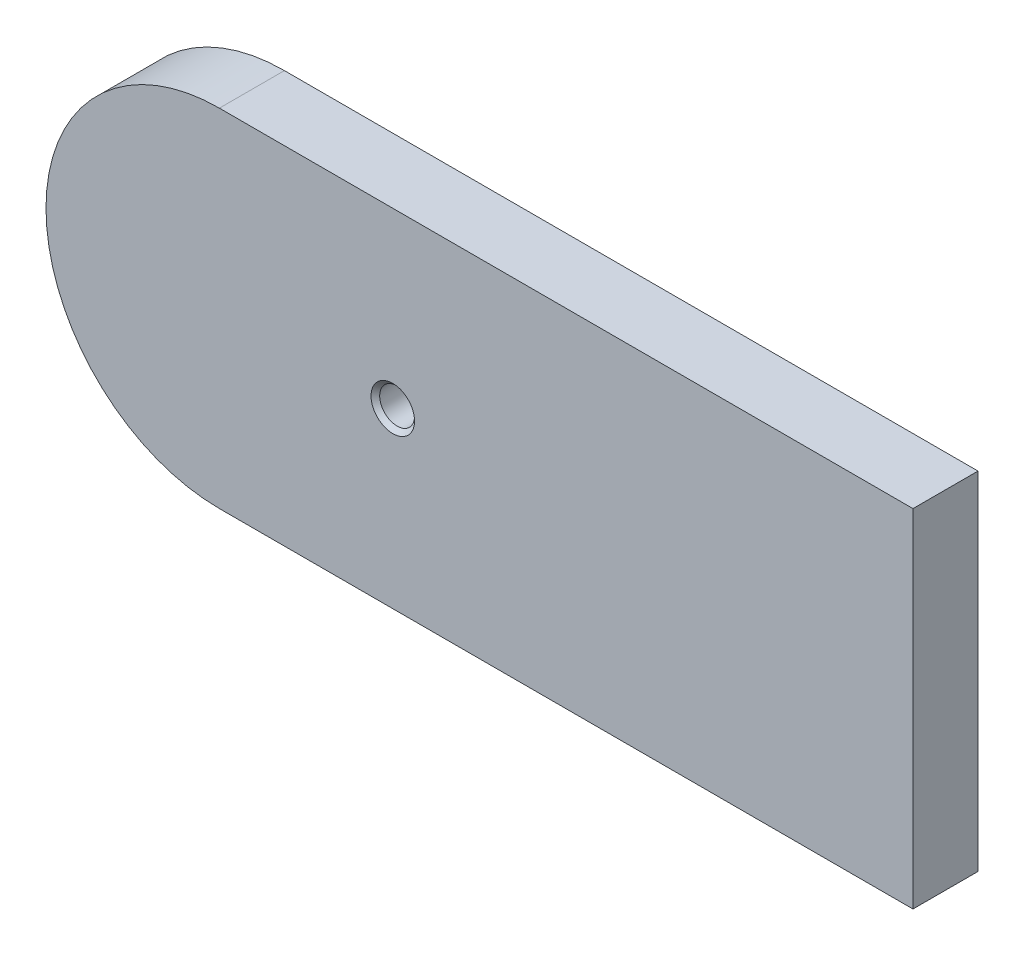
ISO-10303-21;
HEADER;
FILE_DESCRIPTION(('STEP AP214'),'2;1');
FILE_NAME('part.step','',(''),(''),'','','');
FILE_SCHEMA(('AUTOMOTIVE_DESIGN { 1 0 10303 214 1 1 1 1 }'));
ENDSEC;
DATA;
#1=APPLICATION_CONTEXT('core data for automotive mechanical design processes');
#2=APPLICATION_PROTOCOL_DEFINITION('international standard','automotive_design',2000,#1);
#3=PRODUCT_CONTEXT('',#1,'mechanical');
#4=PRODUCT('Part','Part','',(#3));
#5=PRODUCT_RELATED_PRODUCT_CATEGORY('part','',(#4));
#6=PRODUCT_DEFINITION_FORMATION('','',#4);
#7=PRODUCT_DEFINITION_CONTEXT('part definition',#1,'design');
#8=PRODUCT_DEFINITION('design','',#6,#7);
#9=PRODUCT_DEFINITION_SHAPE('','',#8);
#10=(LENGTH_UNIT() NAMED_UNIT(*) SI_UNIT(.MILLI.,.METRE.));
#11=(NAMED_UNIT(*) PLANE_ANGLE_UNIT() SI_UNIT($,.RADIAN.));
#12=(NAMED_UNIT(*) SI_UNIT($,.STERADIAN.) SOLID_ANGLE_UNIT());
#13=UNCERTAINTY_MEASURE_WITH_UNIT(LENGTH_MEASURE(1.E-05),#10,'distance_accuracy_value','');
#14=(GEOMETRIC_REPRESENTATION_CONTEXT(3) GLOBAL_UNCERTAINTY_ASSIGNED_CONTEXT((#13)) GLOBAL_UNIT_ASSIGNED_CONTEXT((#10,
#11,#12)) REPRESENTATION_CONTEXT('',''));
#15=CARTESIAN_POINT('',(0.,0.,0.));
#16=DIRECTION('',(0.,0.,1.));
#17=DIRECTION('',(1.,0.,0.));
#18=AXIS2_PLACEMENT_3D('',#15,#16,#17);
#19=CARTESIAN_POINT('',(-76.2,25.4,9.525));
#20=DIRECTION('',(0.,-1.,0.));
#21=DIRECTION('',(0.,0.,-1.));
#22=AXIS2_PLACEMENT_3D('',#19,#20,#21);
#23=PLANE('',#22);
#24=DIRECTION('',(-1.,0.,0.));
#25=VECTOR('',#24,1.);
#26=CARTESIAN_POINT('',(-76.2,25.4,9.525));
#27=LINE('',#26,#25);
#28=CARTESIAN_POINT('',(50.8,25.4,9.525));
#29=VERTEX_POINT('',#28);
#30=CARTESIAN_POINT('',(-50.8,25.4,9.52500000000001));
#31=VERTEX_POINT('',#30);
#32=EDGE_CURVE('E64',#29,#31,#27,.T.);
#33=ORIENTED_EDGE('',*,*,#32,.F.);
#34=DIRECTION('',(0.,0.,-1.));
#35=VECTOR('',#34,1.);
#36=CARTESIAN_POINT('',(50.8,25.4,9.525));
#37=LINE('',#36,#35);
#38=CARTESIAN_POINT('',(50.8,25.4,0.));
#39=VERTEX_POINT('',#38);
#40=EDGE_CURVE('E123',#29,#39,#37,.T.);
#41=ORIENTED_EDGE('',*,*,#40,.T.);
#42=DIRECTION('',(-1.,0.,0.));
#43=VECTOR('',#42,1.);
#44=CARTESIAN_POINT('',(-76.2,25.4,0.));
#45=LINE('',#44,#43);
#46=CARTESIAN_POINT('',(-50.8,25.4,0.));
#47=VERTEX_POINT('',#46);
#48=EDGE_CURVE('E94',#39,#47,#45,.T.);
#49=ORIENTED_EDGE('',*,*,#48,.T.);
#50=DIRECTION('',(0.,0.,-1.));
#51=VECTOR('',#50,1.);
#52=CARTESIAN_POINT('',(-50.8,25.4,222.588548622403));
#53=LINE('',#52,#51);
#54=EDGE_CURVE('E121',#31,#47,#53,.T.);
#55=ORIENTED_EDGE('',*,*,#54,.F.);
#56=EDGE_LOOP('',(#33,#41,#49,#55));
#57=FACE_BOUND('',#56,.T.);
#58=ADVANCED_FACE('F43',(#57),#23,.F.);
#59=CARTESIAN_POINT('',(0.,0.,9.525));
#60=DIRECTION('',(0.,0.,1.));
#61=DIRECTION('',(1.,0.,0.));
#62=AXIS2_PLACEMENT_3D('',#59,#60,#61);
#63=PLANE('',#62);
#64=DIRECTION('',(0.,-1.,0.));
#65=VECTOR('',#64,1.);
#66=CARTESIAN_POINT('',(50.8,0.,9.525));
#67=LINE('',#66,#65);
#68=CARTESIAN_POINT('',(50.8,-25.4,9.525));
#69=VERTEX_POINT('',#68);
#70=EDGE_CURVE('E58',#29,#69,#67,.T.);
#71=ORIENTED_EDGE('',*,*,#70,.F.);
#72=ORIENTED_EDGE('',*,*,#32,.T.);
#73=CARTESIAN_POINT('',(-50.8,0.,9.52500000000001));
#74=DIRECTION('',(0.,0.,1.));
#75=DIRECTION('',(1.,0.,0.));
#76=AXIS2_PLACEMENT_3D('',#73,#74,#75);
#77=CIRCLE('',#76,25.4);
#78=CARTESIAN_POINT('',(-50.8,-25.4,9.52500000000001));
#79=VERTEX_POINT('',#78);
#80=EDGE_CURVE('E119',#31,#79,#77,.T.);
#81=ORIENTED_EDGE('',*,*,#80,.T.);
#82=DIRECTION('',(1.,0.,0.));
#83=VECTOR('',#82,1.);
#84=CARTESIAN_POINT('',(-76.2,-25.4,9.525));
#85=LINE('',#84,#83);
#86=EDGE_CURVE('E101',#79,#69,#85,.T.);
#87=ORIENTED_EDGE('',*,*,#86,.T.);
#88=EDGE_LOOP('',(#71,#72,#81,#87));
#89=FACE_BOUND('',#88,.T.);
#90=CARTESIAN_POINT('',(-25.4,0.,9.525));
#91=DIRECTION('',(0.,0.,1.));
#92=DIRECTION('',(1.,0.,0.));
#93=AXIS2_PLACEMENT_3D('',#90,#91,#92);
#94=CIRCLE('',#93,3.1877);
#95=CARTESIAN_POINT('',(-22.2123,0.,9.525));
#96=VERTEX_POINT('',#95);
#97=EDGE_CURVE('E113',#96,#96,#94,.T.);
#98=ORIENTED_EDGE('',*,*,#97,.F.);
#99=EDGE_LOOP('',(#98));
#100=FACE_BOUND('',#99,.T.);
#101=ADVANCED_FACE('F127',(#89,#100),#63,.T.);
#102=CARTESIAN_POINT('',(0.,0.,0.));
#103=DIRECTION('',(0.,0.,1.));
#104=DIRECTION('',(1.,0.,0.));
#105=AXIS2_PLACEMENT_3D('',#102,#103,#104);
#106=PLANE('',#105);
#107=CARTESIAN_POINT('',(-25.4,0.,0.));
#108=DIRECTION('',(0.,0.,1.));
#109=DIRECTION('',(1.,0.,0.));
#110=AXIS2_PLACEMENT_3D('',#107,#108,#109);
#111=CIRCLE('',#110,3.1877);
#112=CARTESIAN_POINT('',(-22.2123,0.,0.));
#113=VERTEX_POINT('',#112);
#114=EDGE_CURVE('E116',#113,#113,#111,.T.);
#115=ORIENTED_EDGE('',*,*,#114,.T.);
#116=EDGE_LOOP('',(#115));
#117=FACE_BOUND('',#116,.T.);
#118=ORIENTED_EDGE('',*,*,#48,.F.);
#119=DIRECTION('',(0.,-1.,0.));
#120=VECTOR('',#119,1.);
#121=CARTESIAN_POINT('',(50.8,0.,0.));
#122=LINE('',#121,#120);
#123=CARTESIAN_POINT('',(50.8,-25.4,0.));
#124=VERTEX_POINT('',#123);
#125=EDGE_CURVE('E82',#39,#124,#122,.T.);
#126=ORIENTED_EDGE('',*,*,#125,.T.);
#127=DIRECTION('',(1.,0.,0.));
#128=VECTOR('',#127,1.);
#129=CARTESIAN_POINT('',(-76.2,-25.4,0.));
#130=LINE('',#129,#128);
#131=CARTESIAN_POINT('',(-50.8,-25.4,0.));
#132=VERTEX_POINT('',#131);
#133=EDGE_CURVE('E92',#132,#124,#130,.T.);
#134=ORIENTED_EDGE('',*,*,#133,.F.);
#135=CARTESIAN_POINT('',(-50.8,0.,0.));
#136=DIRECTION('',(0.,0.,1.));
#137=DIRECTION('',(1.,0.,0.));
#138=AXIS2_PLACEMENT_3D('',#135,#136,#137);
#139=CIRCLE('',#138,25.4);
#140=EDGE_CURVE('E51',#47,#132,#139,.T.);
#141=ORIENTED_EDGE('',*,*,#140,.F.);
#142=EDGE_LOOP('',(#118,#126,#134,#141));
#143=FACE_BOUND('',#142,.T.);
#144=ADVANCED_FACE('F90',(#117,#143),#106,.F.);
#145=CARTESIAN_POINT('',(-76.2,-25.4,9.525));
#146=DIRECTION('',(0.,1.,0.));
#147=DIRECTION('',(0.,0.,1.));
#148=AXIS2_PLACEMENT_3D('',#145,#146,#147);
#149=PLANE('',#148);
#150=ORIENTED_EDGE('',*,*,#133,.T.);
#151=DIRECTION('',(0.,0.,1.));
#152=VECTOR('',#151,1.);
#153=CARTESIAN_POINT('',(50.8,-25.4,9.525));
#154=LINE('',#153,#152);
#155=EDGE_CURVE('E13',#124,#69,#154,.T.);
#156=ORIENTED_EDGE('',*,*,#155,.T.);
#157=ORIENTED_EDGE('',*,*,#86,.F.);
#158=DIRECTION('',(0.,0.,-1.));
#159=VECTOR('',#158,1.);
#160=CARTESIAN_POINT('',(-50.8,-25.4,222.588548622403));
#161=LINE('',#160,#159);
#162=EDGE_CURVE('E97',#79,#132,#161,.T.);
#163=ORIENTED_EDGE('',*,*,#162,.T.);
#164=EDGE_LOOP('',(#150,#156,#157,#163));
#165=FACE_BOUND('',#164,.T.);
#166=ADVANCED_FACE('F45',(#165),#149,.F.);
#167=CARTESIAN_POINT('',(-25.4,0.,0.635000000000004));
#168=DIRECTION('',(0.,0.,-1.));
#169=DIRECTION('',(-1.,0.,0.));
#170=AXIS2_PLACEMENT_3D('',#167,#168,#169);
#171=CONICAL_SURFACE('',#170,2.5527,0.785398163397447);
#172=ORIENTED_EDGE('',*,*,#114,.F.);
#173=EDGE_LOOP('',(#172));
#174=FACE_BOUND('',#173,.T.);
#175=CARTESIAN_POINT('',(-25.4,0.,0.635000000000004));
#176=DIRECTION('',(0.,0.,1.));
#177=DIRECTION('',(1.,0.,0.));
#178=AXIS2_PLACEMENT_3D('',#175,#176,#177);
#179=CIRCLE('',#178,2.5527);
#180=CARTESIAN_POINT('',(-22.8473,0.,0.635000000000004));
#181=VERTEX_POINT('',#180);
#182=EDGE_CURVE('E99',#181,#181,#179,.T.);
#183=ORIENTED_EDGE('',*,*,#182,.T.);
#184=EDGE_LOOP('',(#183));
#185=FACE_BOUND('',#184,.T.);
#186=ADVANCED_FACE('F144',(#174,#185),#171,.F.);
#187=CARTESIAN_POINT('',(-25.4,0.,9.525));
#188=DIRECTION('',(0.,0.,1.));
#189=DIRECTION('',(1.,0.,0.));
#190=AXIS2_PLACEMENT_3D('',#187,#188,#189);
#191=CYLINDRICAL_SURFACE('',#190,2.5527);
#192=ORIENTED_EDGE('',*,*,#182,.F.);
#193=EDGE_LOOP('',(#192));
#194=FACE_BOUND('',#193,.T.);
#195=CARTESIAN_POINT('',(-25.4,0.,8.89));
#196=DIRECTION('',(0.,0.,1.));
#197=DIRECTION('',(1.,0.,0.));
#198=AXIS2_PLACEMENT_3D('',#195,#196,#197);
#199=CIRCLE('',#198,2.5527);
#200=CARTESIAN_POINT('',(-22.8473,0.,8.89));
#201=VERTEX_POINT('',#200);
#202=EDGE_CURVE('E104',#201,#201,#199,.T.);
#203=ORIENTED_EDGE('',*,*,#202,.T.);
#204=EDGE_LOOP('',(#203));
#205=FACE_BOUND('',#204,.T.);
#206=ADVANCED_FACE('F136',(#194,#205),#191,.F.);
#207=CARTESIAN_POINT('',(-25.4,0.,9.525));
#208=DIRECTION('',(0.,0.,1.));
#209=DIRECTION('',(1.,0.,0.));
#210=AXIS2_PLACEMENT_3D('',#207,#208,#209);
#211=CONICAL_SURFACE('',#210,3.1877,0.785398163397448);
#212=ORIENTED_EDGE('',*,*,#202,.F.);
#213=EDGE_LOOP('',(#212));
#214=FACE_BOUND('',#213,.T.);
#215=ORIENTED_EDGE('',*,*,#97,.T.);
#216=EDGE_LOOP('',(#215));
#217=FACE_BOUND('',#216,.T.);
#218=ADVANCED_FACE('F133',(#214,#217),#211,.F.);
#219=CARTESIAN_POINT('',(-50.8,0.,222.588548622403));
#220=DIRECTION('',(0.,0.,-1.));
#221=DIRECTION('',(-1.,0.,0.));
#222=AXIS2_PLACEMENT_3D('',#219,#220,#221);
#223=CYLINDRICAL_SURFACE('',#222,25.4);
#224=ORIENTED_EDGE('',*,*,#162,.F.);
#225=ORIENTED_EDGE('',*,*,#80,.F.);
#226=ORIENTED_EDGE('',*,*,#54,.T.);
#227=ORIENTED_EDGE('',*,*,#140,.T.);
#228=EDGE_LOOP('',(#224,#225,#226,#227));
#229=FACE_BOUND('',#228,.T.);
#230=ADVANCED_FACE('F135',(#229),#223,.T.);
#231=CARTESIAN_POINT('',(50.8,-51.7981635767073,210.682298622403));
#232=DIRECTION('',(-1.,0.,0.));
#233=DIRECTION('',(0.,0.,1.));
#234=AXIS2_PLACEMENT_3D('',#231,#232,#233);
#235=PLANE('',#234);
#236=ORIENTED_EDGE('',*,*,#40,.F.);
#237=ORIENTED_EDGE('',*,*,#70,.T.);
#238=ORIENTED_EDGE('',*,*,#155,.F.);
#239=ORIENTED_EDGE('',*,*,#125,.F.);
#240=EDGE_LOOP('',(#236,#237,#238,#239));
#241=FACE_BOUND('',#240,.T.);
#242=ADVANCED_FACE('F81',(#241),#235,.F.);
#243=CLOSED_SHELL('',(#58,#101,#144,#166,#186,#206,#218,#230,#242));
#244=MANIFOLD_SOLID_BREP('B2',#243);
#245=ADVANCED_BREP_SHAPE_REPRESENTATION('',(#18,#244),#14);
#246=SHAPE_DEFINITION_REPRESENTATION(#9,#245);
ENDSEC;
END-ISO-10303-21;
